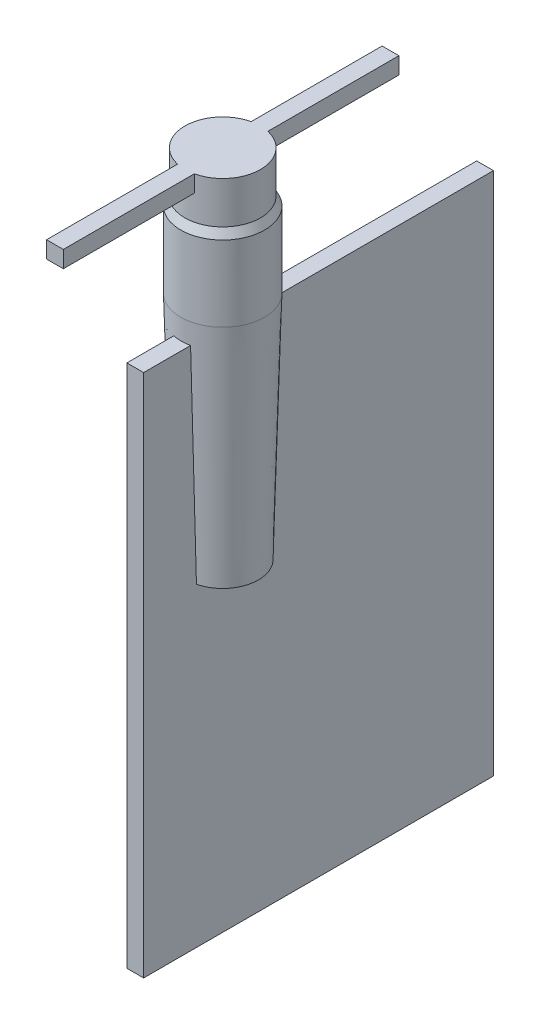
ISO-10303-21;
HEADER;
FILE_DESCRIPTION(('STEP AP214'),'2;1');
FILE_NAME('part.step','',(''),(''),'','','');
FILE_SCHEMA(('AUTOMOTIVE_DESIGN { 1 0 10303 214 1 1 1 1 }'));
ENDSEC;
DATA;
#1=APPLICATION_CONTEXT('core data for automotive mechanical design processes');
#2=APPLICATION_PROTOCOL_DEFINITION('international standard','automotive_design',2000,#1);
#3=PRODUCT_CONTEXT('',#1,'mechanical');
#4=PRODUCT('Part','Part','',(#3));
#5=PRODUCT_RELATED_PRODUCT_CATEGORY('part','',(#4));
#6=PRODUCT_DEFINITION_FORMATION('','',#4);
#7=PRODUCT_DEFINITION_CONTEXT('part definition',#1,'design');
#8=PRODUCT_DEFINITION('design','',#6,#7);
#9=PRODUCT_DEFINITION_SHAPE('','',#8);
#10=(LENGTH_UNIT() NAMED_UNIT(*) SI_UNIT(.MILLI.,.METRE.));
#11=(NAMED_UNIT(*) PLANE_ANGLE_UNIT() SI_UNIT($,.RADIAN.));
#12=(NAMED_UNIT(*) SI_UNIT($,.STERADIAN.) SOLID_ANGLE_UNIT());
#13=UNCERTAINTY_MEASURE_WITH_UNIT(LENGTH_MEASURE(1.E-05),#10,'distance_accuracy_value','');
#14=(GEOMETRIC_REPRESENTATION_CONTEXT(3) GLOBAL_UNCERTAINTY_ASSIGNED_CONTEXT((#13)) GLOBAL_UNIT_ASSIGNED_CONTEXT((#10,
#11,#12)) REPRESENTATION_CONTEXT('',''));
#15=CARTESIAN_POINT('',(0.,0.,0.));
#16=DIRECTION('',(0.,0.,1.));
#17=DIRECTION('',(1.,0.,0.));
#18=AXIS2_PLACEMENT_3D('',#15,#16,#17);
#19=CARTESIAN_POINT('',(0.,-4250.,0.));
#20=DIRECTION('',(0.,-1.,0.));
#21=DIRECTION('',(0.,0.,-1.));
#22=AXIS2_PLACEMENT_3D('',#19,#20,#21);
#23=PLANE('',#22);
#24=CARTESIAN_POINT('',(0.,-4250.,0.));
#25=DIRECTION('',(0.,-1.,0.));
#26=DIRECTION('',(0.,0.,-1.));
#27=AXIS2_PLACEMENT_3D('',#24,#25,#26);
#28=CIRCLE('',#27,425.);
#29=CARTESIAN_POINT('',(-100.,-4250.,413.067791046458));
#30=VERTEX_POINT('',#29);
#31=CARTESIAN_POINT('',(-100.,-4250.,-413.067792265562));
#32=VERTEX_POINT('',#31);
#33=EDGE_CURVE('E246',#30,#32,#28,.T.);
#34=ORIENTED_EDGE('',*,*,#33,.T.);
#35=DIRECTION('',(0.,0.,1.));
#36=VECTOR('',#35,1.);
#37=CARTESIAN_POINT('',(-100.,-4250.,0.));
#38=LINE('',#37,#36);
#39=EDGE_CURVE('E239',#32,#30,#38,.T.);
#40=ORIENTED_EDGE('',*,*,#39,.T.);
#41=EDGE_LOOP('',(#34,#40));
#42=FACE_BOUND('',#41,.T.);
#43=ADVANCED_FACE('F39',(#42),#23,.T.);
#44=CARTESIAN_POINT('',(0.,-500.,0.));
#45=DIRECTION('',(0.,1.,0.));
#46=DIRECTION('',(0.,0.,1.));
#47=AXIS2_PLACEMENT_3D('',#44,#45,#46);
#48=CYLINDRICAL_SURFACE('',#47,450.);
#49=DIRECTION('',(0.,1.,0.));
#50=VECTOR('',#49,1.);
#51=CARTESIAN_POINT('',(100.,-500.,438.748219369606));
#52=LINE('',#51,#50);
#53=CARTESIAN_POINT('',(100.,-200.,438.748219369606));
#54=VERTEX_POINT('',#53);
#55=CARTESIAN_POINT('',(100.,0.,438.748219369606));
#56=VERTEX_POINT('',#55);
#57=EDGE_CURVE('E202',#54,#56,#52,.T.);
#58=ORIENTED_EDGE('',*,*,#57,.F.);
#59=CARTESIAN_POINT('',(0.,-200.,0.));
#60=DIRECTION('',(0.,-1.,0.));
#61=DIRECTION('',(0.,0.,-1.));
#62=AXIS2_PLACEMENT_3D('',#59,#60,#61);
#63=CIRCLE('',#62,450.);
#64=CARTESIAN_POINT('',(-99.9999999999999,-200.,438.748219369606));
#65=VERTEX_POINT('',#64);
#66=EDGE_CURVE('E12',#65,#54,#63,.F.);
#67=ORIENTED_EDGE('',*,*,#66,.F.);
#68=DIRECTION('',(0.,1.,0.));
#69=VECTOR('',#68,1.);
#70=CARTESIAN_POINT('',(-99.9999999999999,-500.,438.748219369606));
#71=LINE('',#70,#69);
#72=CARTESIAN_POINT('',(-99.9999999999999,0.,438.748219369606));
#73=VERTEX_POINT('',#72);
#74=EDGE_CURVE('E200',#73,#65,#71,.F.);
#75=ORIENTED_EDGE('',*,*,#74,.F.);
#76=CARTESIAN_POINT('',(0.,0.,0.));
#77=DIRECTION('',(0.,1.,0.));
#78=DIRECTION('',(0.,0.,1.));
#79=AXIS2_PLACEMENT_3D('',#76,#77,#78);
#80=CIRCLE('',#79,450.);
#81=CARTESIAN_POINT('',(-99.9999999999999,0.,-438.748219369606));
#82=VERTEX_POINT('',#81);
#83=EDGE_CURVE('E370',#82,#73,#80,.T.);
#84=ORIENTED_EDGE('',*,*,#83,.F.);
#85=DIRECTION('',(0.,1.,0.));
#86=VECTOR('',#85,1.);
#87=CARTESIAN_POINT('',(-99.9999999999999,-500.,-438.748219369606));
#88=LINE('',#87,#86);
#89=CARTESIAN_POINT('',(-99.9999999999999,-200.,-438.748219369606));
#90=VERTEX_POINT('',#89);
#91=EDGE_CURVE('E194',#90,#82,#88,.T.);
#92=ORIENTED_EDGE('',*,*,#91,.F.);
#93=CARTESIAN_POINT('',(100.,-200.,-438.748219369606));
#94=VERTEX_POINT('',#93);
#95=EDGE_CURVE('E43',#94,#90,#63,.F.);
#96=ORIENTED_EDGE('',*,*,#95,.F.);
#97=DIRECTION('',(0.,1.,0.));
#98=VECTOR('',#97,1.);
#99=CARTESIAN_POINT('',(100.,-500.,-438.748219369606));
#100=LINE('',#99,#98);
#101=CARTESIAN_POINT('',(100.,0.,-438.748219369606));
#102=VERTEX_POINT('',#101);
#103=EDGE_CURVE('E160',#102,#94,#100,.F.);
#104=ORIENTED_EDGE('',*,*,#103,.F.);
#105=EDGE_CURVE('E361',#56,#102,#80,.T.);
#106=ORIENTED_EDGE('',*,*,#105,.F.);
#107=EDGE_LOOP('',(#58,#67,#75,#84,#92,#96,#104,#106));
#108=FACE_BOUND('',#107,.T.);
#109=CARTESIAN_POINT('',(0.,-500.,0.));
#110=DIRECTION('',(0.,-1.,0.));
#111=DIRECTION('',(0.,0.,-1.));
#112=AXIS2_PLACEMENT_3D('',#109,#110,#111);
#113=CIRCLE('',#112,450.);
#114=CARTESIAN_POINT('',(0.,-500.,-450.));
#115=VERTEX_POINT('',#114);
#116=EDGE_CURVE('E372',#115,#115,#113,.T.);
#117=ORIENTED_EDGE('',*,*,#116,.F.);
#118=EDGE_LOOP('',(#117));
#119=FACE_BOUND('',#118,.T.);
#120=ADVANCED_FACE('F41',(#108,#119),#48,.T.);
#121=CARTESIAN_POINT('',(0.,0.,0.));
#122=DIRECTION('',(0.,1.,0.));
#123=DIRECTION('',(0.,0.,1.));
#124=AXIS2_PLACEMENT_3D('',#121,#122,#123);
#125=PLANE('',#124);
#126=ORIENTED_EDGE('',*,*,#83,.T.);
#127=DIRECTION('',(0.,0.,1.));
#128=VECTOR('',#127,1.);
#129=CARTESIAN_POINT('',(-99.9999999999999,0.,2000.));
#130=LINE('',#129,#128);
#131=CARTESIAN_POINT('',(-99.9999999999999,0.,2000.));
#132=VERTEX_POINT('',#131);
#133=EDGE_CURVE('E189',#73,#132,#130,.T.);
#134=ORIENTED_EDGE('',*,*,#133,.T.);
#135=DIRECTION('',(1.,0.,0.));
#136=VECTOR('',#135,1.);
#137=CARTESIAN_POINT('',(-99.9999999999999,0.,2000.));
#138=LINE('',#137,#136);
#139=CARTESIAN_POINT('',(100.,0.,2000.));
#140=VERTEX_POINT('',#139);
#141=EDGE_CURVE('E165',#132,#140,#138,.T.);
#142=ORIENTED_EDGE('',*,*,#141,.T.);
#143=DIRECTION('',(0.,0.,-1.));
#144=VECTOR('',#143,1.);
#145=CARTESIAN_POINT('',(100.,0.,2000.));
#146=LINE('',#145,#144);
#147=EDGE_CURVE('E61',#140,#56,#146,.T.);
#148=ORIENTED_EDGE('',*,*,#147,.T.);
#149=ORIENTED_EDGE('',*,*,#105,.T.);
#150=CARTESIAN_POINT('',(100.,0.,-2000.));
#151=VERTEX_POINT('',#150);
#152=EDGE_CURVE('E187',#102,#151,#146,.T.);
#153=ORIENTED_EDGE('',*,*,#152,.T.);
#154=DIRECTION('',(-1.,0.,0.));
#155=VECTOR('',#154,1.);
#156=CARTESIAN_POINT('',(-99.9999999999999,0.,-2000.));
#157=LINE('',#156,#155);
#158=CARTESIAN_POINT('',(-99.9999999999999,0.,-2000.));
#159=VERTEX_POINT('',#158);
#160=EDGE_CURVE('E171',#151,#159,#157,.T.);
#161=ORIENTED_EDGE('',*,*,#160,.T.);
#162=EDGE_CURVE('E54',#159,#82,#130,.T.);
#163=ORIENTED_EDGE('',*,*,#162,.T.);
#164=EDGE_LOOP('',(#126,#134,#142,#148,#149,#153,#161,#163));
#165=FACE_BOUND('',#164,.T.);
#166=ADVANCED_FACE('F338',(#165),#125,.T.);
#167=CARTESIAN_POINT('',(0.,-600.,0.));
#168=DIRECTION('',(0.,-1.,0.));
#169=DIRECTION('',(0.,0.,-1.));
#170=AXIS2_PLACEMENT_3D('',#167,#168,#169);
#171=CONICAL_SURFACE('',#170,500.,0.463647609000804);
#172=ORIENTED_EDGE('',*,*,#116,.T.);
#173=EDGE_LOOP('',(#172));
#174=FACE_BOUND('',#173,.T.);
#175=CARTESIAN_POINT('',(0.,-600.,0.));
#176=DIRECTION('',(0.,-1.,0.));
#177=DIRECTION('',(0.,0.,-1.));
#178=AXIS2_PLACEMENT_3D('',#175,#176,#177);
#179=CIRCLE('',#178,500.);
#180=CARTESIAN_POINT('',(0.,-600.,-500.));
#181=VERTEX_POINT('',#180);
#182=EDGE_CURVE('E375',#181,#181,#179,.T.);
#183=ORIENTED_EDGE('',*,*,#182,.F.);
#184=EDGE_LOOP('',(#183));
#185=FACE_BOUND('',#184,.T.);
#186=ADVANCED_FACE('F347',(#174,#185),#171,.T.);
#187=CARTESIAN_POINT('',(0.,-1500.,0.));
#188=DIRECTION('',(0.,-1.,0.));
#189=DIRECTION('',(0.,0.,-1.));
#190=AXIS2_PLACEMENT_3D('',#187,#188,#189);
#191=CYLINDRICAL_SURFACE('',#190,500.);
#192=ORIENTED_EDGE('',*,*,#182,.T.);
#193=EDGE_LOOP('',(#192));
#194=FACE_BOUND('',#193,.T.);
#195=CARTESIAN_POINT('',(0.,-1500.,0.));
#196=DIRECTION('',(0.,1.,0.));
#197=DIRECTION('',(0.,0.,1.));
#198=AXIS2_PLACEMENT_3D('',#195,#196,#197);
#199=CIRCLE('',#198,500.);
#200=CARTESIAN_POINT('',(0.,-1500.,500.));
#201=VERTEX_POINT('',#200);
#202=EDGE_CURVE('E379',#201,#201,#199,.F.);
#203=ORIENTED_EDGE('',*,*,#202,.F.);
#204=EDGE_LOOP('',(#203));
#205=FACE_BOUND('',#204,.T.);
#206=ADVANCED_FACE('F342',(#194,#205),#191,.T.);
#207=DIRECTION('',(0.,0.,1.));
#208=VECTOR('',#207,1.);
#209=CARTESIAN_POINT('',(100.,-4250.,0.));
#210=LINE('',#209,#208);
#211=CARTESIAN_POINT('',(100.,-4250.,-413.067790915741));
#212=VERTEX_POINT('',#211);
#213=CARTESIAN_POINT('',(100.,-4250.,413.067791046458));
#214=VERTEX_POINT('',#213);
#215=EDGE_CURVE('E242',#212,#214,#210,.T.);
#216=ORIENTED_EDGE('',*,*,#215,.F.);
#217=EDGE_CURVE('E255',#212,#214,#28,.T.);
#218=ORIENTED_EDGE('',*,*,#217,.T.);
#219=EDGE_LOOP('',(#216,#218));
#220=FACE_BOUND('',#219,.T.);
#221=ADVANCED_FACE('F273',(#220),#23,.T.);
#222=CARTESIAN_POINT('',(0.,-4250.,0.));
#223=DIRECTION('',(0.,1.,0.));
#224=DIRECTION('',(0.,0.,1.));
#225=AXIS2_PLACEMENT_3D('',#222,#223,#224);
#226=CONICAL_SURFACE('',#225,425.,0.0272659684555945);
#227=CARTESIAN_POINT('',(100.,942.582696414921,-557.72176643028));
#228=CARTESIAN_POINT('',(100.,758.793754028909,-552.629400712317));
#229=CARTESIAN_POINT('',(100.,575.004871455083,-547.534876315687));
#230=CARTESIAN_POINT('',(100.,207.427235876635,-537.341104891443));
#231=CARTESIAN_POINT('',(100.,23.6384828720143,-532.241857863793));
#232=CARTESIAN_POINT('',(100.,-527.727568232142,-516.936424885863));
#233=CARTESIAN_POINT('',(100.,-895.304652858058,-506.72254719474));
#234=CARTESIAN_POINT('',(100.,-1630.45814066345,-486.27028544391));
#235=CARTESIAN_POINT('',(100.,-1998.03454384292,-476.031901384191));
#236=CARTESIAN_POINT('',(100.,-2549.39852516511,-460.652034200697));
#237=CARTESIAN_POINT('',(100.,-2733.18641422634,-455.521696646399));
#238=CARTESIAN_POINT('',(100.,-3100.76196220156,-445.2527838099));
#239=CARTESIAN_POINT('',(100.,-3284.54962111554,-440.114208527699));
#240=CARTESIAN_POINT('',(100.,-3652.12468312062,-429.827919328194));
#241=CARTESIAN_POINT('',(100.,-3835.91208621172,-424.680205410894));
#242=CARTESIAN_POINT('',(100.,-4203.48660677295,-414.3745911779));
#243=CARTESIAN_POINT('',(100.,-4387.27372424308,-409.216690862207));
#244=CARTESIAN_POINT('',(100.,-4768.68841548795,-398.500627497359));
#245=CARTESIAN_POINT('',(100.,-4966.31596424084,-392.941573739767));
#246=CARTESIAN_POINT('',(100.,-5361.57064041676,-381.808513384708));
#247=CARTESIAN_POINT('',(100.,-5559.19776783979,-376.234506787257));
#248=CARTESIAN_POINT('',(100.,-5954.45154344751,-365.06943016085));
#249=CARTESIAN_POINT('',(100.,-6152.07819163218,-359.478360131665));
#250=CARTESIAN_POINT('',(100.,-6448.51774724977,-351.077044537029));
#251=CARTESIAN_POINT('',(100.,-6547.33086316008,-348.274154242807));
#252=CARTESIAN_POINT('',(100.,-6744.95694502262,-342.663090490847));
#253=CARTESIAN_POINT('',(100.,-6843.76991097486,-339.854917033107));
#254=CARTESIAN_POINT('',(100.,-6942.58279641492,-337.043912170266));
#255=B_SPLINE_CURVE_WITH_KNOTS('',3,(#227,#228,#229,#230,#231,#232,#233,#234,#235,#236,#237,
#238,#239,#240,#241,#242,#243,#244,#245,#246,#247,#248,#249,#250,#251,#252,#253,#254),
.UNSPECIFIED.,.F.,.F.,(4,2,2,2,2,2,2,2,2,2,2,2,2,4),(0.,551.578433014668,1103.15687023351,
2206.31376136932,3309.47065306725,3861.0490940844,4412.62753501183,4964.20597563701,
5515.78441612798,6108.90157094735,6702.01872519172,7295.13588740875,7591.69446940365,
7888.25305153835),.UNSPECIFIED.);
#256=CARTESIAN_POINT('',(100.,-1750.,-482.937165462676));
#257=VERTEX_POINT('',#256);
#258=EDGE_CURVE('E309',#257,#212,#255,.T.);
#259=ORIENTED_EDGE('',*,*,#258,.F.);
#260=CARTESIAN_POINT('',(0.,-1750.,0.));
#261=DIRECTION('',(0.,-1.,0.));
#262=DIRECTION('',(0.,0.,-1.));
#263=AXIS2_PLACEMENT_3D('',#260,#261,#262);
#264=CIRCLE('',#263,493.181818181818);
#265=CARTESIAN_POINT('',(-100.,-1750.,-482.937165462676));
#266=VERTEX_POINT('',#265);
#267=EDGE_CURVE('E359',#257,#266,#264,.F.);
#268=ORIENTED_EDGE('',*,*,#267,.T.);
#269=CARTESIAN_POINT('',(-100.,942.582696414921,-557.72176643028));
#270=CARTESIAN_POINT('',(-100.,758.793754028909,-552.629400712317));
#271=CARTESIAN_POINT('',(-100.,575.004871455083,-547.534876315687));
#272=CARTESIAN_POINT('',(-100.,207.427235876635,-537.341104891443));
#273=CARTESIAN_POINT('',(-100.,23.6384828720143,-532.241857863793));
#274=CARTESIAN_POINT('',(-100.,-527.727568232142,-516.936424885863));
#275=CARTESIAN_POINT('',(-100.,-895.304652858058,-506.72254719474));
#276=CARTESIAN_POINT('',(-100.,-1630.45814066345,-486.27028544391));
#277=CARTESIAN_POINT('',(-100.,-1998.03454384292,-476.031901384191));
#278=CARTESIAN_POINT('',(-100.,-2549.39852516511,-460.652034200697));
#279=CARTESIAN_POINT('',(-100.,-2733.18641422634,-455.521696646399));
#280=CARTESIAN_POINT('',(-100.,-3100.76196220156,-445.2527838099));
#281=CARTESIAN_POINT('',(-100.,-3284.54962111554,-440.114208527699));
#282=CARTESIAN_POINT('',(-100.,-3652.12468312062,-429.827919328194));
#283=CARTESIAN_POINT('',(-100.,-3835.91208621172,-424.680205410894));
#284=CARTESIAN_POINT('',(-100.,-4203.48660677295,-414.3745911779));
#285=CARTESIAN_POINT('',(-100.,-4387.27372424308,-409.216690862207));
#286=CARTESIAN_POINT('',(-100.,-4768.68841548795,-398.500627497359));
#287=CARTESIAN_POINT('',(-100.,-4966.31596424084,-392.941573739767));
#288=CARTESIAN_POINT('',(-100.,-5361.57064041676,-381.808513384708));
#289=CARTESIAN_POINT('',(-100.,-5559.19776783979,-376.234506787257));
#290=CARTESIAN_POINT('',(-100.,-5954.45154344751,-365.06943016085));
#291=CARTESIAN_POINT('',(-100.,-6152.07819163218,-359.478360131665));
#292=CARTESIAN_POINT('',(-100.,-6448.51774724977,-351.077044537029));
#293=CARTESIAN_POINT('',(-100.,-6547.33086316008,-348.274154242807));
#294=CARTESIAN_POINT('',(-100.,-6744.95694502262,-342.663090490847));
#295=CARTESIAN_POINT('',(-100.,-6843.76991097486,-339.854917033107));
#296=CARTESIAN_POINT('',(-100.,-6942.58279641492,-337.043912170266));
#297=B_SPLINE_CURVE_WITH_KNOTS('',3,(#269,#270,#271,#272,#273,#274,#275,#276,#277,#278,#279,
#280,#281,#282,#283,#284,#285,#286,#287,#288,#289,#290,#291,#292,#293,#294,#295,#296),
.UNSPECIFIED.,.F.,.F.,(4,2,2,2,2,2,2,2,2,2,2,2,2,4),(0.,551.578433014668,1103.15687023351,
2206.31376136932,3309.47065306725,3861.0490940844,4412.62753501183,4964.20597563701,
5515.78441612798,6108.90157094735,6702.01872519172,7295.13588740875,7591.69446940365,
7888.25305153835),.UNSPECIFIED.);
#298=EDGE_CURVE('E308',#266,#32,#297,.T.);
#299=ORIENTED_EDGE('',*,*,#298,.T.);
#300=ORIENTED_EDGE('',*,*,#33,.F.);
#301=CARTESIAN_POINT('',(-100.,-6942.58279641492,337.043912170266));
#302=CARTESIAN_POINT('',(-100.,-6828.55036413531,340.287875704381));
#303=CARTESIAN_POINT('',(-100.,-6714.51782478099,343.528073347256));
#304=CARTESIAN_POINT('',(-100.,-6486.45254896994,350.0015099041));
#305=CARTESIAN_POINT('',(-100.,-6372.4198125132,353.234748818095));
#306=CARTESIAN_POINT('',(-100.,-6030.32132860662,362.924887173356));
#307=CARTESIAN_POINT('',(-100.,-5802.25530981179,369.372208137147));
#308=CARTESIAN_POINT('',(-100.,-5346.12265723798,382.245062653934));
#309=CARTESIAN_POINT('',(-100.,-5118.056023459,388.670596206904));
#310=CARTESIAN_POINT('',(-100.,-4661.9222254055,401.50290191088));
#311=CARTESIAN_POINT('',(-100.,-4433.85506113098,407.90967406166));
#312=CARTESIAN_POINT('',(-100.,-3977.72027622798,420.706946958341));
#313=CARTESIAN_POINT('',(-100.,-3749.65265559949,427.09744770425));
#314=CARTESIAN_POINT('',(-100.,-3335.5786727323,438.686972318099));
#315=CARTESIAN_POINT('',(-100.,-3149.57237708279,443.888375617219));
#316=CARTESIAN_POINT('',(-100.,-2777.55954792847,454.282669646218));
#317=CARTESIAN_POINT('',(-100.,-2591.55301442366,459.475560376095));
#318=CARTESIAN_POINT('',(-100.,-2033.53309276272,475.042737880618));
#319=CARTESIAN_POINT('',(-100.,-1661.51938389701,485.405529957932));
#320=CARTESIAN_POINT('',(-100.,-1103.49830132076,500.930794165837));
#321=CARTESIAN_POINT('',(-100.,-917.491190746795,506.102728153385));
#322=CARTESIAN_POINT('',(-100.,-545.476809172149,516.440824087545));
#323=CARTESIAN_POINT('',(-100.,-359.469538171472,521.606986034157));
#324=CARTESIAN_POINT('',(-100.,12.5451494416061,531.934040134774));
#325=CARTESIAN_POINT('',(-100.,198.552566054007,537.094932288799));
#326=CARTESIAN_POINT('',(-100.,570.567533531328,547.411874256154));
#327=CARTESIAN_POINT('',(-100.,756.575084396249,552.567924069487));
#328=CARTESIAN_POINT('',(-100.,942.582696414923,557.72176643028));
#329=B_SPLINE_CURVE_WITH_KNOTS('',3,(#301,#302,#303,#304,#305,#306,#307,#308,#309,#310,#311,
#312,#313,#314,#315,#316,#317,#318,#319,#320,#321,#322,#323,#324,#325,#326,#327,#328),
.UNSPECIFIED.,.F.,.F.,(4,2,2,2,2,2,2,2,2,2,2,2,2,4),(0.,342.235693775505,684.47138628869,
1368.94278089311,2053.41417632092,2737.88557997888,3422.35698333487,3980.59400228296,
4538.83102131164,5655.30506068015,6213.54205936999,6771.77905809428,7330.01605482038,
7888.25305142643),.UNSPECIFIED.);
#330=CARTESIAN_POINT('',(-100.,-1750.,482.937165462676));
#331=VERTEX_POINT('',#330);
#332=EDGE_CURVE('E360',#30,#331,#329,.T.);
#333=ORIENTED_EDGE('',*,*,#332,.T.);
#334=CARTESIAN_POINT('',(100.,-1750.,482.937165462676));
#335=VERTEX_POINT('',#334);
#336=EDGE_CURVE('E357',#331,#335,#264,.F.);
#337=ORIENTED_EDGE('',*,*,#336,.T.);
#338=CARTESIAN_POINT('',(100.,-6942.58279641492,337.043912170266));
#339=CARTESIAN_POINT('',(100.,-6828.55036413531,340.287875704381));
#340=CARTESIAN_POINT('',(100.,-6714.51782478099,343.528073347256));
#341=CARTESIAN_POINT('',(100.,-6486.45254896994,350.0015099041));
#342=CARTESIAN_POINT('',(100.,-6372.4198125132,353.234748818095));
#343=CARTESIAN_POINT('',(100.,-6030.32132860662,362.924887173356));
#344=CARTESIAN_POINT('',(100.,-5802.25530981179,369.372208137147));
#345=CARTESIAN_POINT('',(100.,-5346.12265723798,382.245062653934));
#346=CARTESIAN_POINT('',(100.,-5118.056023459,388.670596206904));
#347=CARTESIAN_POINT('',(100.,-4661.9222254055,401.50290191088));
#348=CARTESIAN_POINT('',(100.,-4433.85506113098,407.90967406166));
#349=CARTESIAN_POINT('',(100.,-3977.72027622798,420.706946958341));
#350=CARTESIAN_POINT('',(100.,-3749.65265559949,427.09744770425));
#351=CARTESIAN_POINT('',(100.,-3335.5786727323,438.686972318099));
#352=CARTESIAN_POINT('',(100.,-3149.57237708279,443.888375617219));
#353=CARTESIAN_POINT('',(100.,-2777.55954792847,454.282669646218));
#354=CARTESIAN_POINT('',(100.,-2591.55301442366,459.475560376095));
#355=CARTESIAN_POINT('',(100.,-2033.53309276272,475.042737880618));
#356=CARTESIAN_POINT('',(100.,-1661.51938389701,485.405529957932));
#357=CARTESIAN_POINT('',(100.,-1103.49830132076,500.930794165837));
#358=CARTESIAN_POINT('',(100.,-917.491190746795,506.102728153385));
#359=CARTESIAN_POINT('',(100.,-545.476809172149,516.440824087545));
#360=CARTESIAN_POINT('',(100.,-359.469538171472,521.606986034157));
#361=CARTESIAN_POINT('',(100.,12.5451494416061,531.934040134774));
#362=CARTESIAN_POINT('',(100.,198.552566054007,537.094932288799));
#363=CARTESIAN_POINT('',(100.,570.567533531328,547.411874256154));
#364=CARTESIAN_POINT('',(100.,756.575084396249,552.567924069487));
#365=CARTESIAN_POINT('',(100.,942.582696414923,557.72176643028));
#366=B_SPLINE_CURVE_WITH_KNOTS('',3,(#338,#339,#340,#341,#342,#343,#344,#345,#346,#347,#348,
#349,#350,#351,#352,#353,#354,#355,#356,#357,#358,#359,#360,#361,#362,#363,#364,#365),
.UNSPECIFIED.,.F.,.F.,(4,2,2,2,2,2,2,2,2,2,2,2,2,4),(0.,342.235693775505,684.47138628869,
1368.94278089311,2053.41417632092,2737.88557997888,3422.35698333487,3980.59400228296,
4538.83102131164,5655.30506068015,6213.54205936999,6771.77905809428,7330.01605482038,
7888.25305142643),.UNSPECIFIED.);
#367=EDGE_CURVE('E351',#214,#335,#366,.T.);
#368=ORIENTED_EDGE('',*,*,#367,.F.);
#369=ORIENTED_EDGE('',*,*,#217,.F.);
#370=EDGE_LOOP('',(#259,#268,#299,#300,#333,#337,#368,#369));
#371=FACE_BOUND('',#370,.T.);
#372=ORIENTED_EDGE('',*,*,#202,.T.);
#373=EDGE_LOOP('',(#372));
#374=FACE_BOUND('',#373,.T.);
#375=ADVANCED_FACE('F262',(#371,#374),#226,.T.);
#376=CARTESIAN_POINT('',(100.,-1750.,1042.5));
#377=DIRECTION('',(0.,-1.,0.));
#378=DIRECTION('',(0.,0.,-1.));
#379=AXIS2_PLACEMENT_3D('',#376,#377,#378);
#380=PLANE('',#379);
#381=ORIENTED_EDGE('',*,*,#336,.F.);
#382=DIRECTION('',(0.,0.,1.));
#383=VECTOR('',#382,1.);
#384=CARTESIAN_POINT('',(-100.,-1750.,1042.5));
#385=LINE('',#384,#383);
#386=CARTESIAN_POINT('',(-100.,-1750.,1042.5));
#387=VERTEX_POINT('',#386);
#388=EDGE_CURVE('E225',#331,#387,#385,.T.);
#389=ORIENTED_EDGE('',*,*,#388,.T.);
#390=DIRECTION('',(-1.,0.,0.));
#391=VECTOR('',#390,1.);
#392=CARTESIAN_POINT('',(100.,-1750.,1042.5));
#393=LINE('',#392,#391);
#394=CARTESIAN_POINT('',(100.,-1750.,1042.5));
#395=VERTEX_POINT('',#394);
#396=EDGE_CURVE('E218',#395,#387,#393,.T.);
#397=ORIENTED_EDGE('',*,*,#396,.F.);
#398=DIRECTION('',(0.,0.,1.));
#399=VECTOR('',#398,1.);
#400=CARTESIAN_POINT('',(100.,-1750.,1042.5));
#401=LINE('',#400,#399);
#402=EDGE_CURVE('E214',#335,#395,#401,.T.);
#403=ORIENTED_EDGE('',*,*,#402,.F.);
#404=EDGE_LOOP('',(#381,#389,#397,#403));
#405=FACE_BOUND('',#404,.T.);
#406=ADVANCED_FACE('F272',(#405),#380,.F.);
#407=CARTESIAN_POINT('',(100.,-1750.,1042.5));
#408=DIRECTION('',(0.,0.,-1.));
#409=DIRECTION('',(0.,1.,0.));
#410=AXIS2_PLACEMENT_3D('',#407,#408,#409);
#411=PLANE('',#410);
#412=DIRECTION('',(0.,-1.,0.));
#413=VECTOR('',#412,1.);
#414=CARTESIAN_POINT('',(-100.,-1750.,1042.5));
#415=LINE('',#414,#413);
#416=CARTESIAN_POINT('',(-100.,-8000.,1042.5));
#417=VERTEX_POINT('',#416);
#418=EDGE_CURVE('E205',#387,#417,#415,.T.);
#419=ORIENTED_EDGE('',*,*,#418,.T.);
#420=DIRECTION('',(-1.,0.,0.));
#421=VECTOR('',#420,1.);
#422=CARTESIAN_POINT('',(100.,-8000.,1042.5));
#423=LINE('',#422,#421);
#424=CARTESIAN_POINT('',(100.,-8000.,1042.5));
#425=VERTEX_POINT('',#424);
#426=EDGE_CURVE('E236',#425,#417,#423,.T.);
#427=ORIENTED_EDGE('',*,*,#426,.F.);
#428=DIRECTION('',(0.,-1.,0.));
#429=VECTOR('',#428,1.);
#430=CARTESIAN_POINT('',(100.,-1750.,1042.5));
#431=LINE('',#430,#429);
#432=EDGE_CURVE('E206',#395,#425,#431,.T.);
#433=ORIENTED_EDGE('',*,*,#432,.F.);
#434=ORIENTED_EDGE('',*,*,#396,.T.);
#435=EDGE_LOOP('',(#419,#427,#433,#434));
#436=FACE_BOUND('',#435,.T.);
#437=ADVANCED_FACE('F274',(#436),#411,.F.);
#438=CARTESIAN_POINT('',(100.,-8000.,1042.5));
#439=DIRECTION('',(0.,1.,0.));
#440=DIRECTION('',(0.,0.,1.));
#441=AXIS2_PLACEMENT_3D('',#438,#439,#440);
#442=PLANE('',#441);
#443=DIRECTION('',(0.,0.,-1.));
#444=VECTOR('',#443,1.);
#445=CARTESIAN_POINT('',(-100.,-8000.,1042.5));
#446=LINE('',#445,#444);
#447=CARTESIAN_POINT('',(-100.,-8000.,-3127.5));
#448=VERTEX_POINT('',#447);
#449=EDGE_CURVE('E221',#417,#448,#446,.T.);
#450=ORIENTED_EDGE('',*,*,#449,.T.);
#451=DIRECTION('',(-1.,0.,0.));
#452=VECTOR('',#451,1.);
#453=CARTESIAN_POINT('',(100.,-8000.,-3127.5));
#454=LINE('',#453,#452);
#455=CARTESIAN_POINT('',(100.,-8000.,-3127.5));
#456=VERTEX_POINT('',#455);
#457=EDGE_CURVE('E233',#456,#448,#454,.T.);
#458=ORIENTED_EDGE('',*,*,#457,.F.);
#459=DIRECTION('',(0.,0.,-1.));
#460=VECTOR('',#459,1.);
#461=CARTESIAN_POINT('',(100.,-8000.,1042.5));
#462=LINE('',#461,#460);
#463=EDGE_CURVE('E209',#425,#456,#462,.T.);
#464=ORIENTED_EDGE('',*,*,#463,.F.);
#465=ORIENTED_EDGE('',*,*,#426,.T.);
#466=EDGE_LOOP('',(#450,#458,#464,#465));
#467=FACE_BOUND('',#466,.T.);
#468=ADVANCED_FACE('F325',(#467),#442,.F.);
#469=CARTESIAN_POINT('',(100.,-1750.,-3127.5));
#470=DIRECTION('',(0.,0.,1.));
#471=DIRECTION('',(0.,-1.,0.));
#472=AXIS2_PLACEMENT_3D('',#469,#470,#471);
#473=PLANE('',#472);
#474=DIRECTION('',(0.,1.,0.));
#475=VECTOR('',#474,1.);
#476=CARTESIAN_POINT('',(-100.,-1750.,-3127.5));
#477=LINE('',#476,#475);
#478=CARTESIAN_POINT('',(-100.,-1750.,-3127.5));
#479=VERTEX_POINT('',#478);
#480=EDGE_CURVE('E223',#448,#479,#477,.T.);
#481=ORIENTED_EDGE('',*,*,#480,.T.);
#482=DIRECTION('',(-1.,0.,0.));
#483=VECTOR('',#482,1.);
#484=CARTESIAN_POINT('',(100.,-1750.,-3127.5));
#485=LINE('',#484,#483);
#486=CARTESIAN_POINT('',(100.,-1750.,-3127.5));
#487=VERTEX_POINT('',#486);
#488=EDGE_CURVE('E230',#487,#479,#485,.T.);
#489=ORIENTED_EDGE('',*,*,#488,.F.);
#490=DIRECTION('',(0.,1.,0.));
#491=VECTOR('',#490,1.);
#492=CARTESIAN_POINT('',(100.,-1750.,-3127.5));
#493=LINE('',#492,#491);
#494=EDGE_CURVE('E212',#456,#487,#493,.T.);
#495=ORIENTED_EDGE('',*,*,#494,.F.);
#496=ORIENTED_EDGE('',*,*,#457,.T.);
#497=EDGE_LOOP('',(#481,#489,#495,#496));
#498=FACE_BOUND('',#497,.T.);
#499=ADVANCED_FACE('F322',(#498),#473,.F.);
#500=ORIENTED_EDGE('',*,*,#267,.F.);
#501=EDGE_CURVE('E215',#487,#257,#401,.T.);
#502=ORIENTED_EDGE('',*,*,#501,.F.);
#503=ORIENTED_EDGE('',*,*,#488,.T.);
#504=EDGE_CURVE('E210',#479,#266,#385,.T.);
#505=ORIENTED_EDGE('',*,*,#504,.T.);
#506=EDGE_LOOP('',(#500,#502,#503,#505));
#507=FACE_BOUND('',#506,.T.);
#508=ADVANCED_FACE('F318',(#507),#380,.F.);
#509=CARTESIAN_POINT('',(100.,0.,0.));
#510=DIRECTION('',(1.,0.,0.));
#511=DIRECTION('',(0.,0.,-1.));
#512=AXIS2_PLACEMENT_3D('',#509,#510,#511);
#513=PLANE('',#512);
#514=ORIENTED_EDGE('',*,*,#501,.T.);
#515=ORIENTED_EDGE('',*,*,#258,.T.);
#516=ORIENTED_EDGE('',*,*,#215,.T.);
#517=ORIENTED_EDGE('',*,*,#367,.T.);
#518=ORIENTED_EDGE('',*,*,#402,.T.);
#519=ORIENTED_EDGE('',*,*,#432,.T.);
#520=ORIENTED_EDGE('',*,*,#463,.T.);
#521=ORIENTED_EDGE('',*,*,#494,.T.);
#522=EDGE_LOOP('',(#514,#515,#516,#517,#518,#519,#520,#521));
#523=FACE_BOUND('',#522,.T.);
#524=ADVANCED_FACE('F314',(#523),#513,.T.);
#525=CARTESIAN_POINT('',(-100.,0.,0.));
#526=DIRECTION('',(1.,0.,0.));
#527=DIRECTION('',(0.,0.,-1.));
#528=AXIS2_PLACEMENT_3D('',#525,#526,#527);
#529=PLANE('',#528);
#530=ORIENTED_EDGE('',*,*,#298,.F.);
#531=ORIENTED_EDGE('',*,*,#504,.F.);
#532=ORIENTED_EDGE('',*,*,#480,.F.);
#533=ORIENTED_EDGE('',*,*,#449,.F.);
#534=ORIENTED_EDGE('',*,*,#418,.F.);
#535=ORIENTED_EDGE('',*,*,#388,.F.);
#536=ORIENTED_EDGE('',*,*,#332,.F.);
#537=ORIENTED_EDGE('',*,*,#39,.F.);
#538=EDGE_LOOP('',(#530,#531,#532,#533,#534,#535,#536,#537));
#539=FACE_BOUND('',#538,.T.);
#540=ADVANCED_FACE('F310',(#539),#529,.F.);
#541=CARTESIAN_POINT('',(-99.9999999999999,-200.,-2000.));
#542=DIRECTION('',(0.,0.,-1.));
#543=DIRECTION('',(-1.,0.,0.));
#544=AXIS2_PLACEMENT_3D('',#541,#542,#543);
#545=PLANE('',#544);
#546=ORIENTED_EDGE('',*,*,#160,.F.);
#547=DIRECTION('',(0.,1.,0.));
#548=VECTOR('',#547,1.);
#549=CARTESIAN_POINT('',(100.,-200.,-2000.));
#550=LINE('',#549,#548);
#551=CARTESIAN_POINT('',(100.,-200.,-2000.));
#552=VERTEX_POINT('',#551);
#553=EDGE_CURVE('E157',#552,#151,#550,.T.);
#554=ORIENTED_EDGE('',*,*,#553,.F.);
#555=DIRECTION('',(-1.,0.,0.));
#556=VECTOR('',#555,1.);
#557=CARTESIAN_POINT('',(-99.9999999999999,-200.,-2000.));
#558=LINE('',#557,#556);
#559=CARTESIAN_POINT('',(-99.9999999999999,-200.,-2000.));
#560=VERTEX_POINT('',#559);
#561=EDGE_CURVE('E170',#552,#560,#558,.T.);
#562=ORIENTED_EDGE('',*,*,#561,.T.);
#563=DIRECTION('',(0.,1.,0.));
#564=VECTOR('',#563,1.);
#565=CARTESIAN_POINT('',(-99.9999999999999,-200.,-2000.));
#566=LINE('',#565,#564);
#567=EDGE_CURVE('E172',#560,#159,#566,.T.);
#568=ORIENTED_EDGE('',*,*,#567,.T.);
#569=EDGE_LOOP('',(#546,#554,#562,#568));
#570=FACE_BOUND('',#569,.T.);
#571=ADVANCED_FACE('F169',(#570),#545,.T.);
#572=CARTESIAN_POINT('',(0.,-200.,0.));
#573=DIRECTION('',(0.,-1.,0.));
#574=DIRECTION('',(0.,0.,-1.));
#575=AXIS2_PLACEMENT_3D('',#572,#573,#574);
#576=PLANE('',#575);
#577=DIRECTION('',(0.,0.,-1.));
#578=VECTOR('',#577,1.);
#579=CARTESIAN_POINT('',(100.,-200.,2000.));
#580=LINE('',#579,#578);
#581=EDGE_CURVE('E154',#94,#552,#580,.T.);
#582=ORIENTED_EDGE('',*,*,#581,.F.);
#583=ORIENTED_EDGE('',*,*,#95,.T.);
#584=DIRECTION('',(0.,0.,1.));
#585=VECTOR('',#584,1.);
#586=CARTESIAN_POINT('',(-99.9999999999999,-200.,2000.));
#587=LINE('',#586,#585);
#588=EDGE_CURVE('E178',#560,#90,#587,.T.);
#589=ORIENTED_EDGE('',*,*,#588,.F.);
#590=ORIENTED_EDGE('',*,*,#561,.F.);
#591=EDGE_LOOP('',(#582,#583,#589,#590));
#592=FACE_BOUND('',#591,.T.);
#593=ADVANCED_FACE('F176',(#592),#576,.T.);
#594=CARTESIAN_POINT('',(-99.9999999999999,-200.,2000.));
#595=DIRECTION('',(-1.,0.,0.));
#596=DIRECTION('',(0.,0.,1.));
#597=AXIS2_PLACEMENT_3D('',#594,#595,#596);
#598=PLANE('',#597);
#599=ORIENTED_EDGE('',*,*,#588,.T.);
#600=ORIENTED_EDGE('',*,*,#91,.T.);
#601=ORIENTED_EDGE('',*,*,#162,.F.);
#602=ORIENTED_EDGE('',*,*,#567,.F.);
#603=EDGE_LOOP('',(#599,#600,#601,#602));
#604=FACE_BOUND('',#603,.T.);
#605=ADVANCED_FACE('F365',(#604),#598,.T.);
#606=CARTESIAN_POINT('',(100.,-200.,2000.));
#607=DIRECTION('',(1.,0.,0.));
#608=DIRECTION('',(0.,0.,-1.));
#609=AXIS2_PLACEMENT_3D('',#606,#607,#608);
#610=PLANE('',#609);
#611=ORIENTED_EDGE('',*,*,#152,.F.);
#612=ORIENTED_EDGE('',*,*,#103,.T.);
#613=ORIENTED_EDGE('',*,*,#581,.T.);
#614=ORIENTED_EDGE('',*,*,#553,.T.);
#615=EDGE_LOOP('',(#611,#612,#613,#614));
#616=FACE_BOUND('',#615,.T.);
#617=ADVANCED_FACE('F156',(#616),#610,.T.);
#618=CARTESIAN_POINT('',(-99.9999999999999,-200.,2000.));
#619=VERTEX_POINT('',#618);
#620=EDGE_CURVE('E179',#65,#619,#587,.T.);
#621=ORIENTED_EDGE('',*,*,#620,.F.);
#622=ORIENTED_EDGE('',*,*,#66,.T.);
#623=CARTESIAN_POINT('',(100.,-200.,2000.));
#624=VERTEX_POINT('',#623);
#625=EDGE_CURVE('E164',#624,#54,#580,.T.);
#626=ORIENTED_EDGE('',*,*,#625,.F.);
#627=DIRECTION('',(1.,0.,0.));
#628=VECTOR('',#627,1.);
#629=CARTESIAN_POINT('',(-99.9999999999999,-200.,2000.));
#630=LINE('',#629,#628);
#631=EDGE_CURVE('E173',#619,#624,#630,.T.);
#632=ORIENTED_EDGE('',*,*,#631,.F.);
#633=EDGE_LOOP('',(#621,#622,#626,#632));
#634=FACE_BOUND('',#633,.T.);
#635=ADVANCED_FACE('F510',(#634),#576,.T.);
#636=ORIENTED_EDGE('',*,*,#133,.F.);
#637=ORIENTED_EDGE('',*,*,#74,.T.);
#638=ORIENTED_EDGE('',*,*,#620,.T.);
#639=DIRECTION('',(0.,1.,0.));
#640=VECTOR('',#639,1.);
#641=CARTESIAN_POINT('',(-99.9999999999999,-200.,2000.));
#642=LINE('',#641,#640);
#643=EDGE_CURVE('E195',#619,#132,#642,.T.);
#644=ORIENTED_EDGE('',*,*,#643,.T.);
#645=EDGE_LOOP('',(#636,#637,#638,#644));
#646=FACE_BOUND('',#645,.T.);
#647=ADVANCED_FACE('F518',(#646),#598,.T.);
#648=ORIENTED_EDGE('',*,*,#625,.T.);
#649=ORIENTED_EDGE('',*,*,#57,.T.);
#650=ORIENTED_EDGE('',*,*,#147,.F.);
#651=DIRECTION('',(0.,1.,0.));
#652=VECTOR('',#651,1.);
#653=CARTESIAN_POINT('',(100.,-200.,2000.));
#654=LINE('',#653,#652);
#655=EDGE_CURVE('E192',#624,#140,#654,.T.);
#656=ORIENTED_EDGE('',*,*,#655,.F.);
#657=EDGE_LOOP('',(#648,#649,#650,#656));
#658=FACE_BOUND('',#657,.T.);
#659=ADVANCED_FACE('F525',(#658),#610,.T.);
#660=CARTESIAN_POINT('',(-99.9999999999999,-200.,2000.));
#661=DIRECTION('',(0.,0.,1.));
#662=DIRECTION('',(1.,0.,0.));
#663=AXIS2_PLACEMENT_3D('',#660,#661,#662);
#664=PLANE('',#663);
#665=ORIENTED_EDGE('',*,*,#141,.F.);
#666=ORIENTED_EDGE('',*,*,#643,.F.);
#667=ORIENTED_EDGE('',*,*,#631,.T.);
#668=ORIENTED_EDGE('',*,*,#655,.T.);
#669=EDGE_LOOP('',(#665,#666,#667,#668));
#670=FACE_BOUND('',#669,.T.);
#671=ADVANCED_FACE('F546',(#670),#664,.T.);
#672=CLOSED_SHELL('',(#43,#120,#166,#186,#206,#221,#375,#406,#437,#468,#499,#508,#524,#540,#571,
#593,#605,#617,#635,#647,#659,#671));
#673=MANIFOLD_SOLID_BREP('B2',#672);
#674=ADVANCED_BREP_SHAPE_REPRESENTATION('',(#18,#673),#14);
#675=SHAPE_DEFINITION_REPRESENTATION(#9,#674);
ENDSEC;
END-ISO-10303-21;
